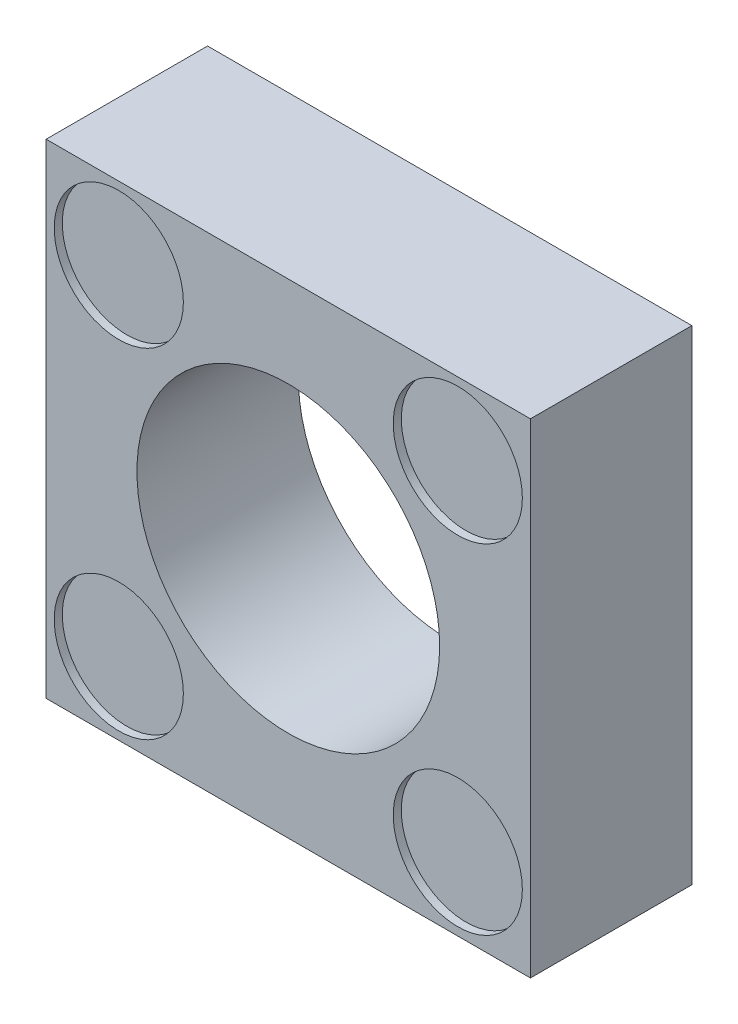
ISO-10303-21;
HEADER;
FILE_DESCRIPTION(('STEP AP214'),'2;1');
FILE_NAME('part.step','',(''),(''),'','','');
FILE_SCHEMA(('AUTOMOTIVE_DESIGN { 1 0 10303 214 1 1 1 1 }'));
ENDSEC;
DATA;
#1=APPLICATION_CONTEXT('core data for automotive mechanical design processes');
#2=APPLICATION_PROTOCOL_DEFINITION('international standard','automotive_design',2000,#1);
#3=PRODUCT_CONTEXT('',#1,'mechanical');
#4=PRODUCT('Part','Part','',(#3));
#5=PRODUCT_RELATED_PRODUCT_CATEGORY('part','',(#4));
#6=PRODUCT_DEFINITION_FORMATION('','',#4);
#7=PRODUCT_DEFINITION_CONTEXT('part definition',#1,'design');
#8=PRODUCT_DEFINITION('design','',#6,#7);
#9=PRODUCT_DEFINITION_SHAPE('','',#8);
#10=(LENGTH_UNIT() NAMED_UNIT(*) SI_UNIT(.MILLI.,.METRE.));
#11=(NAMED_UNIT(*) PLANE_ANGLE_UNIT() SI_UNIT($,.RADIAN.));
#12=(NAMED_UNIT(*) SI_UNIT($,.STERADIAN.) SOLID_ANGLE_UNIT());
#13=UNCERTAINTY_MEASURE_WITH_UNIT(LENGTH_MEASURE(1.E-05),#10,'distance_accuracy_value','');
#14=(GEOMETRIC_REPRESENTATION_CONTEXT(3) GLOBAL_UNCERTAINTY_ASSIGNED_CONTEXT((#13)) GLOBAL_UNIT_ASSIGNED_CONTEXT((#10,
#11,#12)) REPRESENTATION_CONTEXT('',''));
#15=CARTESIAN_POINT('',(0.,0.,0.));
#16=DIRECTION('',(0.,0.,1.));
#17=DIRECTION('',(1.,0.,0.));
#18=AXIS2_PLACEMENT_3D('',#15,#16,#17);
#19=CARTESIAN_POINT('',(0.,0.,200.));
#20=DIRECTION('',(0.,0.,1.));
#21=DIRECTION('',(1.,0.,0.));
#22=AXIS2_PLACEMENT_3D('',#19,#20,#21);
#23=PLANE('',#22);
#24=CARTESIAN_POINT('',(-210.,-210.,200.));
#25=DIRECTION('',(0.,0.,1.));
#26=DIRECTION('',(1.,0.,0.));
#27=AXIS2_PLACEMENT_3D('',#24,#25,#26);
#28=CIRCLE('',#27,80.);
#29=CARTESIAN_POINT('',(-130.,-210.,200.));
#30=VERTEX_POINT('',#29);
#31=EDGE_CURVE('E156',#30,#30,#28,.T.);
#32=ORIENTED_EDGE('',*,*,#31,.F.);
#33=EDGE_LOOP('',(#32));
#34=FACE_BOUND('',#33,.T.);
#35=CARTESIAN_POINT('',(210.,-210.,200.));
#36=DIRECTION('',(0.,0.,1.));
#37=DIRECTION('',(1.,0.,0.));
#38=AXIS2_PLACEMENT_3D('',#35,#36,#37);
#39=CIRCLE('',#38,80.);
#40=CARTESIAN_POINT('',(290.,-210.,200.));
#41=VERTEX_POINT('',#40);
#42=EDGE_CURVE('E164',#41,#41,#39,.T.);
#43=ORIENTED_EDGE('',*,*,#42,.F.);
#44=EDGE_LOOP('',(#43));
#45=FACE_BOUND('',#44,.T.);
#46=CARTESIAN_POINT('',(210.,210.,200.));
#47=DIRECTION('',(0.,0.,1.));
#48=DIRECTION('',(1.,0.,0.));
#49=AXIS2_PLACEMENT_3D('',#46,#47,#48);
#50=CIRCLE('',#49,80.);
#51=CARTESIAN_POINT('',(290.,210.,200.));
#52=VERTEX_POINT('',#51);
#53=EDGE_CURVE('E148',#52,#52,#50,.T.);
#54=ORIENTED_EDGE('',*,*,#53,.F.);
#55=EDGE_LOOP('',(#54));
#56=FACE_BOUND('',#55,.T.);
#57=CARTESIAN_POINT('',(-210.,210.,200.));
#58=DIRECTION('',(0.,0.,1.));
#59=DIRECTION('',(1.,0.,0.));
#60=AXIS2_PLACEMENT_3D('',#57,#58,#59);
#61=CIRCLE('',#60,79.9999999999999);
#62=CARTESIAN_POINT('',(-130.,210.,200.));
#63=VERTEX_POINT('',#62);
#64=EDGE_CURVE('E144',#63,#63,#61,.T.);
#65=ORIENTED_EDGE('',*,*,#64,.F.);
#66=EDGE_LOOP('',(#65));
#67=FACE_BOUND('',#66,.T.);
#68=DIRECTION('',(0.,1.,0.));
#69=VECTOR('',#68,1.);
#70=CARTESIAN_POINT('',(300.,300.,200.));
#71=LINE('',#70,#69);
#72=CARTESIAN_POINT('',(300.,-300.,200.));
#73=VERTEX_POINT('',#72);
#74=CARTESIAN_POINT('',(300.,300.,200.));
#75=VERTEX_POINT('',#74);
#76=EDGE_CURVE('E98',#73,#75,#71,.T.);
#77=ORIENTED_EDGE('',*,*,#76,.T.);
#78=DIRECTION('',(-1.,0.,0.));
#79=VECTOR('',#78,1.);
#80=CARTESIAN_POINT('',(-300.,300.,200.));
#81=LINE('',#80,#79);
#82=CARTESIAN_POINT('',(-300.,300.,200.));
#83=VERTEX_POINT('',#82);
#84=EDGE_CURVE('E93',#75,#83,#81,.T.);
#85=ORIENTED_EDGE('',*,*,#84,.T.);
#86=DIRECTION('',(0.,-1.,0.));
#87=VECTOR('',#86,1.);
#88=CARTESIAN_POINT('',(-300.,300.,200.));
#89=LINE('',#88,#87);
#90=CARTESIAN_POINT('',(-300.,-300.,200.));
#91=VERTEX_POINT('',#90);
#92=EDGE_CURVE('E96',#83,#91,#89,.T.);
#93=ORIENTED_EDGE('',*,*,#92,.T.);
#94=DIRECTION('',(1.,0.,0.));
#95=VECTOR('',#94,1.);
#96=CARTESIAN_POINT('',(-300.,-300.,200.));
#97=LINE('',#96,#95);
#98=EDGE_CURVE('E63',#91,#73,#97,.T.);
#99=ORIENTED_EDGE('',*,*,#98,.T.);
#100=EDGE_LOOP('',(#77,#85,#93,#99));
#101=FACE_BOUND('',#100,.T.);
#102=CARTESIAN_POINT('',(0.,1.11022302462516E-13,200.));
#103=DIRECTION('',(0.,0.,1.));
#104=DIRECTION('',(1.,0.,0.));
#105=AXIS2_PLACEMENT_3D('',#102,#103,#104);
#106=CIRCLE('',#105,187.5);
#107=CARTESIAN_POINT('',(187.5,1.11022302462516E-13,200.));
#108=VERTEX_POINT('',#107);
#109=EDGE_CURVE('E118',#108,#108,#106,.T.);
#110=ORIENTED_EDGE('',*,*,#109,.F.);
#111=EDGE_LOOP('',(#110));
#112=FACE_BOUND('',#111,.T.);
#113=ADVANCED_FACE('F45',(#34,#45,#56,#67,#101,#112),#23,.T.);
#114=CARTESIAN_POINT('',(0.,0.,0.));
#115=DIRECTION('',(0.,0.,1.));
#116=DIRECTION('',(1.,0.,0.));
#117=AXIS2_PLACEMENT_3D('',#114,#115,#116);
#118=PLANE('',#117);
#119=DIRECTION('',(0.,1.,0.));
#120=VECTOR('',#119,1.);
#121=CARTESIAN_POINT('',(300.,300.,0.));
#122=LINE('',#121,#120);
#123=CARTESIAN_POINT('',(300.,-300.,0.));
#124=VERTEX_POINT('',#123);
#125=CARTESIAN_POINT('',(300.,300.,0.));
#126=VERTEX_POINT('',#125);
#127=EDGE_CURVE('E114',#124,#126,#122,.T.);
#128=ORIENTED_EDGE('',*,*,#127,.F.);
#129=DIRECTION('',(1.,0.,0.));
#130=VECTOR('',#129,1.);
#131=CARTESIAN_POINT('',(-300.,-300.,0.));
#132=LINE('',#131,#130);
#133=CARTESIAN_POINT('',(-300.,-300.,0.));
#134=VERTEX_POINT('',#133);
#135=EDGE_CURVE('E86',#134,#124,#132,.T.);
#136=ORIENTED_EDGE('',*,*,#135,.F.);
#137=DIRECTION('',(0.,-1.,0.));
#138=VECTOR('',#137,1.);
#139=CARTESIAN_POINT('',(-300.,300.,0.));
#140=LINE('',#139,#138);
#141=CARTESIAN_POINT('',(-300.,300.,0.));
#142=VERTEX_POINT('',#141);
#143=EDGE_CURVE('E80',#142,#134,#140,.T.);
#144=ORIENTED_EDGE('',*,*,#143,.F.);
#145=DIRECTION('',(-1.,0.,0.));
#146=VECTOR('',#145,1.);
#147=CARTESIAN_POINT('',(-300.,300.,0.));
#148=LINE('',#147,#146);
#149=EDGE_CURVE('E103',#126,#142,#148,.T.);
#150=ORIENTED_EDGE('',*,*,#149,.F.);
#151=EDGE_LOOP('',(#128,#136,#144,#150));
#152=FACE_BOUND('',#151,.T.);
#153=CARTESIAN_POINT('',(0.,1.11022302462516E-13,0.));
#154=DIRECTION('',(0.,0.,1.));
#155=DIRECTION('',(1.,0.,0.));
#156=AXIS2_PLACEMENT_3D('',#153,#154,#155);
#157=CIRCLE('',#156,187.5);
#158=CARTESIAN_POINT('',(187.5,1.11022302462516E-13,0.));
#159=VERTEX_POINT('',#158);
#160=EDGE_CURVE('E136',#159,#159,#157,.T.);
#161=ORIENTED_EDGE('',*,*,#160,.T.);
#162=EDGE_LOOP('',(#161));
#163=FACE_BOUND('',#162,.T.);
#164=ADVANCED_FACE('F131',(#152,#163),#118,.F.);
#165=CARTESIAN_POINT('',(300.,300.,200.));
#166=DIRECTION('',(-1.,0.,0.));
#167=DIRECTION('',(0.,-1.,0.));
#168=AXIS2_PLACEMENT_3D('',#165,#166,#167);
#169=PLANE('',#168);
#170=ORIENTED_EDGE('',*,*,#127,.T.);
#171=DIRECTION('',(0.,0.,-1.));
#172=VECTOR('',#171,1.);
#173=CARTESIAN_POINT('',(300.,300.,200.));
#174=LINE('',#173,#172);
#175=EDGE_CURVE('E11',#75,#126,#174,.T.);
#176=ORIENTED_EDGE('',*,*,#175,.F.);
#177=ORIENTED_EDGE('',*,*,#76,.F.);
#178=DIRECTION('',(0.,0.,-1.));
#179=VECTOR('',#178,1.);
#180=CARTESIAN_POINT('',(300.,-300.,200.));
#181=LINE('',#180,#179);
#182=EDGE_CURVE('E110',#73,#124,#181,.T.);
#183=ORIENTED_EDGE('',*,*,#182,.T.);
#184=EDGE_LOOP('',(#170,#176,#177,#183));
#185=FACE_BOUND('',#184,.T.);
#186=ADVANCED_FACE('F47',(#185),#169,.F.);
#187=CARTESIAN_POINT('',(-300.,300.,200.));
#188=DIRECTION('',(0.,-1.,0.));
#189=DIRECTION('',(0.,0.,-1.));
#190=AXIS2_PLACEMENT_3D('',#187,#188,#189);
#191=PLANE('',#190);
#192=ORIENTED_EDGE('',*,*,#149,.T.);
#193=DIRECTION('',(0.,0.,-1.));
#194=VECTOR('',#193,1.);
#195=CARTESIAN_POINT('',(-300.,300.,200.));
#196=LINE('',#195,#194);
#197=EDGE_CURVE('E55',#83,#142,#196,.T.);
#198=ORIENTED_EDGE('',*,*,#197,.F.);
#199=ORIENTED_EDGE('',*,*,#84,.F.);
#200=ORIENTED_EDGE('',*,*,#175,.T.);
#201=EDGE_LOOP('',(#192,#198,#199,#200));
#202=FACE_BOUND('',#201,.T.);
#203=ADVANCED_FACE('F102',(#202),#191,.F.);
#204=CARTESIAN_POINT('',(-300.,300.,200.));
#205=DIRECTION('',(1.,0.,0.));
#206=DIRECTION('',(0.,0.,-1.));
#207=AXIS2_PLACEMENT_3D('',#204,#205,#206);
#208=PLANE('',#207);
#209=ORIENTED_EDGE('',*,*,#143,.T.);
#210=DIRECTION('',(0.,0.,-1.));
#211=VECTOR('',#210,1.);
#212=CARTESIAN_POINT('',(-300.,-300.,200.));
#213=LINE('',#212,#211);
#214=EDGE_CURVE('E105',#91,#134,#213,.T.);
#215=ORIENTED_EDGE('',*,*,#214,.F.);
#216=ORIENTED_EDGE('',*,*,#92,.F.);
#217=ORIENTED_EDGE('',*,*,#197,.T.);
#218=EDGE_LOOP('',(#209,#215,#216,#217));
#219=FACE_BOUND('',#218,.T.);
#220=ADVANCED_FACE('F106',(#219),#208,.F.);
#221=CARTESIAN_POINT('',(-300.,-300.,200.));
#222=DIRECTION('',(0.,1.,0.));
#223=DIRECTION('',(0.,0.,1.));
#224=AXIS2_PLACEMENT_3D('',#221,#222,#223);
#225=PLANE('',#224);
#226=ORIENTED_EDGE('',*,*,#135,.T.);
#227=ORIENTED_EDGE('',*,*,#182,.F.);
#228=ORIENTED_EDGE('',*,*,#98,.F.);
#229=ORIENTED_EDGE('',*,*,#214,.T.);
#230=EDGE_LOOP('',(#226,#227,#228,#229));
#231=FACE_BOUND('',#230,.T.);
#232=ADVANCED_FACE('F128',(#231),#225,.F.);
#233=CARTESIAN_POINT('',(0.,1.11022302462516E-13,200.));
#234=DIRECTION('',(0.,0.,-1.));
#235=DIRECTION('',(-1.,0.,0.));
#236=AXIS2_PLACEMENT_3D('',#233,#234,#235);
#237=CYLINDRICAL_SURFACE('',#236,187.5);
#238=ORIENTED_EDGE('',*,*,#109,.T.);
#239=EDGE_LOOP('',(#238));
#240=FACE_BOUND('',#239,.T.);
#241=ORIENTED_EDGE('',*,*,#160,.F.);
#242=EDGE_LOOP('',(#241));
#243=FACE_BOUND('',#242,.T.);
#244=ADVANCED_FACE('F187',(#240,#243),#237,.F.);
#245=CARTESIAN_POINT('',(-210.,210.,190.));
#246=DIRECTION('',(0.,0.,1.));
#247=DIRECTION('',(1.,0.,0.));
#248=AXIS2_PLACEMENT_3D('',#245,#246,#247);
#249=CYLINDRICAL_SURFACE('',#248,79.9999999999999);
#250=CARTESIAN_POINT('',(-210.,210.,190.));
#251=DIRECTION('',(0.,0.,1.));
#252=DIRECTION('',(1.,0.,0.));
#253=AXIS2_PLACEMENT_3D('',#250,#251,#252);
#254=CIRCLE('',#253,79.9999999999999);
#255=CARTESIAN_POINT('',(-130.,210.,190.));
#256=VERTEX_POINT('',#255);
#257=EDGE_CURVE('E140',#256,#256,#254,.T.);
#258=ORIENTED_EDGE('',*,*,#257,.F.);
#259=EDGE_LOOP('',(#258));
#260=FACE_BOUND('',#259,.T.);
#261=ORIENTED_EDGE('',*,*,#64,.T.);
#262=EDGE_LOOP('',(#261));
#263=FACE_BOUND('',#262,.T.);
#264=ADVANCED_FACE('F184',(#260,#263),#249,.F.);
#265=CARTESIAN_POINT('',(-210.,210.,190.));
#266=DIRECTION('',(0.,0.,1.));
#267=DIRECTION('',(1.,0.,0.));
#268=AXIS2_PLACEMENT_3D('',#265,#266,#267);
#269=PLANE('',#268);
#270=ORIENTED_EDGE('',*,*,#257,.T.);
#271=EDGE_LOOP('',(#270));
#272=FACE_BOUND('',#271,.T.);
#273=ADVANCED_FACE('F186',(#272),#269,.T.);
#274=CARTESIAN_POINT('',(210.,210.,190.));
#275=DIRECTION('',(0.,0.,1.));
#276=DIRECTION('',(1.,0.,0.));
#277=AXIS2_PLACEMENT_3D('',#274,#275,#276);
#278=CYLINDRICAL_SURFACE('',#277,80.);
#279=CARTESIAN_POINT('',(210.,210.,190.));
#280=DIRECTION('',(0.,0.,1.));
#281=DIRECTION('',(1.,0.,0.));
#282=AXIS2_PLACEMENT_3D('',#279,#280,#281);
#283=CIRCLE('',#282,80.);
#284=CARTESIAN_POINT('',(290.,210.,190.));
#285=VERTEX_POINT('',#284);
#286=EDGE_CURVE('E168',#285,#285,#283,.T.);
#287=ORIENTED_EDGE('',*,*,#286,.F.);
#288=EDGE_LOOP('',(#287));
#289=FACE_BOUND('',#288,.T.);
#290=ORIENTED_EDGE('',*,*,#53,.T.);
#291=EDGE_LOOP('',(#290));
#292=FACE_BOUND('',#291,.T.);
#293=ADVANCED_FACE('F176',(#289,#292),#278,.F.);
#294=CARTESIAN_POINT('',(210.,210.,190.));
#295=DIRECTION('',(0.,0.,1.));
#296=DIRECTION('',(1.,0.,0.));
#297=AXIS2_PLACEMENT_3D('',#294,#295,#296);
#298=PLANE('',#297);
#299=ORIENTED_EDGE('',*,*,#286,.T.);
#300=EDGE_LOOP('',(#299));
#301=FACE_BOUND('',#300,.T.);
#302=ADVANCED_FACE('F264',(#301),#298,.T.);
#303=CARTESIAN_POINT('',(210.,-210.,190.));
#304=DIRECTION('',(0.,0.,1.));
#305=DIRECTION('',(1.,0.,0.));
#306=AXIS2_PLACEMENT_3D('',#303,#304,#305);
#307=CYLINDRICAL_SURFACE('',#306,80.);
#308=CARTESIAN_POINT('',(210.,-210.,190.));
#309=DIRECTION('',(0.,0.,1.));
#310=DIRECTION('',(1.,0.,0.));
#311=AXIS2_PLACEMENT_3D('',#308,#309,#310);
#312=CIRCLE('',#311,80.);
#313=CARTESIAN_POINT('',(290.,-210.,190.));
#314=VERTEX_POINT('',#313);
#315=EDGE_CURVE('E160',#314,#314,#312,.T.);
#316=ORIENTED_EDGE('',*,*,#315,.F.);
#317=EDGE_LOOP('',(#316));
#318=FACE_BOUND('',#317,.T.);
#319=ORIENTED_EDGE('',*,*,#42,.T.);
#320=EDGE_LOOP('',(#319));
#321=FACE_BOUND('',#320,.T.);
#322=ADVANCED_FACE('F273',(#318,#321),#307,.F.);
#323=CARTESIAN_POINT('',(210.,-210.,190.));
#324=DIRECTION('',(0.,0.,1.));
#325=DIRECTION('',(1.,0.,0.));
#326=AXIS2_PLACEMENT_3D('',#323,#324,#325);
#327=PLANE('',#326);
#328=ORIENTED_EDGE('',*,*,#315,.T.);
#329=EDGE_LOOP('',(#328));
#330=FACE_BOUND('',#329,.T.);
#331=ADVANCED_FACE('F282',(#330),#327,.T.);
#332=CARTESIAN_POINT('',(-210.,-210.,190.));
#333=DIRECTION('',(0.,0.,1.));
#334=DIRECTION('',(1.,0.,0.));
#335=AXIS2_PLACEMENT_3D('',#332,#333,#334);
#336=CYLINDRICAL_SURFACE('',#335,80.);
#337=CARTESIAN_POINT('',(-210.,-210.,190.));
#338=DIRECTION('',(0.,0.,1.));
#339=DIRECTION('',(1.,0.,0.));
#340=AXIS2_PLACEMENT_3D('',#337,#338,#339);
#341=CIRCLE('',#340,80.);
#342=CARTESIAN_POINT('',(-130.,-210.,190.));
#343=VERTEX_POINT('',#342);
#344=EDGE_CURVE('E152',#343,#343,#341,.T.);
#345=ORIENTED_EDGE('',*,*,#344,.F.);
#346=EDGE_LOOP('',(#345));
#347=FACE_BOUND('',#346,.T.);
#348=ORIENTED_EDGE('',*,*,#31,.T.);
#349=EDGE_LOOP('',(#348));
#350=FACE_BOUND('',#349,.T.);
#351=ADVANCED_FACE('F291',(#347,#350),#336,.F.);
#352=CARTESIAN_POINT('',(-210.,-210.,190.));
#353=DIRECTION('',(0.,0.,1.));
#354=DIRECTION('',(1.,0.,0.));
#355=AXIS2_PLACEMENT_3D('',#352,#353,#354);
#356=PLANE('',#355);
#357=ORIENTED_EDGE('',*,*,#344,.T.);
#358=EDGE_LOOP('',(#357));
#359=FACE_BOUND('',#358,.T.);
#360=ADVANCED_FACE('F300',(#359),#356,.T.);
#361=CLOSED_SHELL('',(#113,#164,#186,#203,#220,#232,#244,#264,#273,#293,#302,#322,#331,#351,#360));
#362=MANIFOLD_SOLID_BREP('B2',#361);
#363=ADVANCED_BREP_SHAPE_REPRESENTATION('',(#18,#362),#14);
#364=SHAPE_DEFINITION_REPRESENTATION(#9,#363);
ENDSEC;
END-ISO-10303-21;
